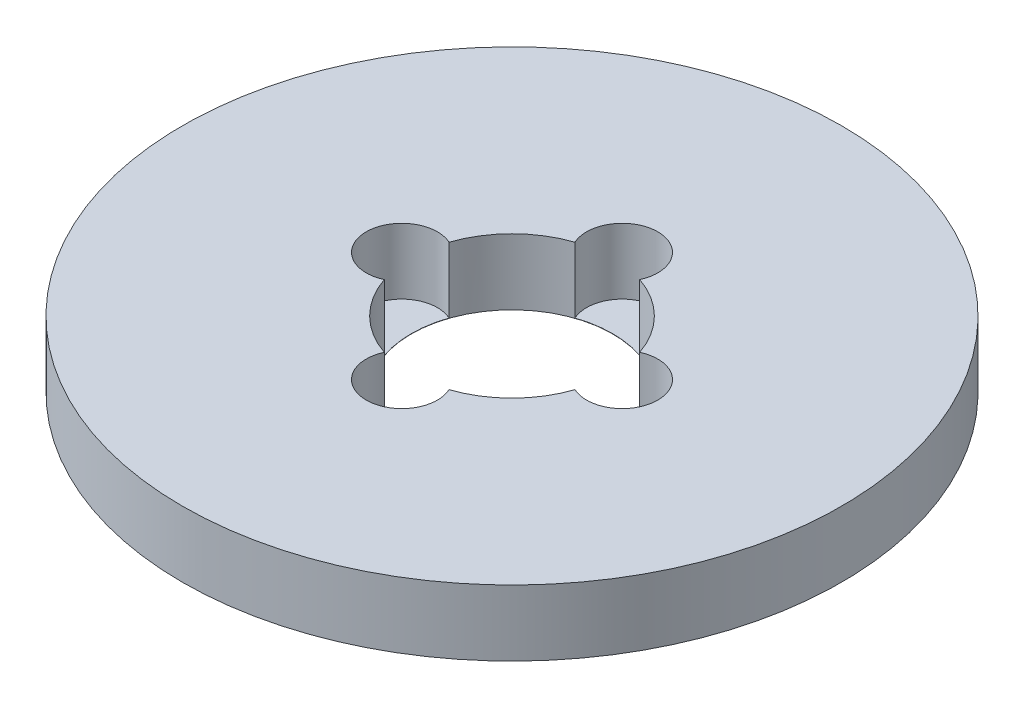
ISO-10303-21;
HEADER;
FILE_DESCRIPTION(('STEP AP214'),'2;1');
FILE_NAME('part.step','',(''),(''),'','','');
FILE_SCHEMA(('AUTOMOTIVE_DESIGN { 1 0 10303 214 1 1 1 1 }'));
ENDSEC;
DATA;
#1=APPLICATION_CONTEXT('core data for automotive mechanical design processes');
#2=APPLICATION_PROTOCOL_DEFINITION('international standard','automotive_design',2000,#1);
#3=PRODUCT_CONTEXT('',#1,'mechanical');
#4=PRODUCT('Part','Part','',(#3));
#5=PRODUCT_RELATED_PRODUCT_CATEGORY('part','',(#4));
#6=PRODUCT_DEFINITION_FORMATION('','',#4);
#7=PRODUCT_DEFINITION_CONTEXT('part definition',#1,'design');
#8=PRODUCT_DEFINITION('design','',#6,#7);
#9=PRODUCT_DEFINITION_SHAPE('','',#8);
#10=(LENGTH_UNIT() NAMED_UNIT(*) SI_UNIT(.MILLI.,.METRE.));
#11=(NAMED_UNIT(*) PLANE_ANGLE_UNIT() SI_UNIT($,.RADIAN.));
#12=(NAMED_UNIT(*) SI_UNIT($,.STERADIAN.) SOLID_ANGLE_UNIT());
#13=UNCERTAINTY_MEASURE_WITH_UNIT(LENGTH_MEASURE(1.E-05),#10,'distance_accuracy_value','');
#14=(GEOMETRIC_REPRESENTATION_CONTEXT(3) GLOBAL_UNCERTAINTY_ASSIGNED_CONTEXT((#13)) GLOBAL_UNIT_ASSIGNED_CONTEXT((#10,
#11,#12)) REPRESENTATION_CONTEXT('',''));
#15=CARTESIAN_POINT('',(0.,0.,0.));
#16=DIRECTION('',(0.,0.,1.));
#17=DIRECTION('',(1.,0.,0.));
#18=AXIS2_PLACEMENT_3D('',#15,#16,#17);
#19=CARTESIAN_POINT('',(0.,18.,0.));
#20=DIRECTION('',(0.,-1.,0.));
#21=DIRECTION('',(0.,0.,-1.));
#22=AXIS2_PLACEMENT_3D('',#19,#20,#21);
#23=CYLINDRICAL_SURFACE('',#22,90.);
#24=CARTESIAN_POINT('',(0.,18.,0.));
#25=DIRECTION('',(0.,1.,0.));
#26=DIRECTION('',(0.,0.,1.));
#27=AXIS2_PLACEMENT_3D('',#24,#25,#26);
#28=CIRCLE('',#27,90.);
#29=CARTESIAN_POINT('',(0.,18.,90.));
#30=VERTEX_POINT('',#29);
#31=EDGE_CURVE('E145',#30,#30,#28,.T.);
#32=ORIENTED_EDGE('',*,*,#31,.F.);
#33=EDGE_LOOP('',(#32));
#34=FACE_BOUND('',#33,.T.);
#35=CARTESIAN_POINT('',(0.,0.,0.));
#36=DIRECTION('',(0.,1.,0.));
#37=DIRECTION('',(0.,0.,1.));
#38=AXIS2_PLACEMENT_3D('',#35,#36,#37);
#39=CIRCLE('',#38,90.);
#40=CARTESIAN_POINT('',(0.,0.,90.));
#41=VERTEX_POINT('',#40);
#42=EDGE_CURVE('E143',#41,#41,#39,.T.);
#43=ORIENTED_EDGE('',*,*,#42,.T.);
#44=EDGE_LOOP('',(#43));
#45=FACE_BOUND('',#44,.T.);
#46=ADVANCED_FACE('F39',(#34,#45),#23,.T.);
#47=CARTESIAN_POINT('',(0.,18.,0.));
#48=DIRECTION('',(0.,1.,0.));
#49=DIRECTION('',(0.,0.,1.));
#50=AXIS2_PLACEMENT_3D('',#47,#48,#49);
#51=PLANE('',#50);
#52=CARTESIAN_POINT('',(1.05056466496162E-13,18.,30.0893678930479));
#53=DIRECTION('',(0.,1.,0.));
#54=DIRECTION('',(1.,0.,0.));
#55=AXIS2_PLACEMENT_3D('',#52,#53,#54);
#56=CIRCLE('',#55,9.72604863078452);
#57=CARTESIAN_POINT('',(-8.84276944870106,18.,26.03949746975));
#58=VERTEX_POINT('',#57);
#59=CARTESIAN_POINT('',(8.84276944870125,18.,26.03949746975));
#60=VERTEX_POINT('',#59);
#61=EDGE_CURVE('E152',#58,#60,#56,.T.);
#62=ORIENTED_EDGE('',*,*,#61,.F.);
#63=CARTESIAN_POINT('',(0.,18.,0.));
#64=DIRECTION('',(0.,1.,0.));
#65=DIRECTION('',(0.,0.,1.));
#66=AXIS2_PLACEMENT_3D('',#63,#64,#65);
#67=CIRCLE('',#66,27.5);
#68=CARTESIAN_POINT('',(-26.03949746975,18.,8.84276944870115));
#69=VERTEX_POINT('',#68);
#70=EDGE_CURVE('E133',#69,#58,#67,.T.);
#71=ORIENTED_EDGE('',*,*,#70,.F.);
#72=CARTESIAN_POINT('',(-30.0893678930479,18.,0.));
#73=DIRECTION('',(0.,1.,0.));
#74=DIRECTION('',(0.,0.,1.));
#75=AXIS2_PLACEMENT_3D('',#72,#73,#74);
#76=CIRCLE('',#75,9.72604863078452);
#77=CARTESIAN_POINT('',(-26.03949746975,18.,-8.84276944870115));
#78=VERTEX_POINT('',#77);
#79=EDGE_CURVE('E128',#78,#69,#76,.T.);
#80=ORIENTED_EDGE('',*,*,#79,.F.);
#81=CARTESIAN_POINT('',(-8.84276944870143,18.,-26.0394974697499));
#82=VERTEX_POINT('',#81);
#83=EDGE_CURVE('E121',#82,#78,#67,.T.);
#84=ORIENTED_EDGE('',*,*,#83,.F.);
#85=CARTESIAN_POINT('',(-3.15169399488487E-13,18.,-30.0893678930479));
#86=DIRECTION('',(0.,1.,0.));
#87=DIRECTION('',(-1.,0.,0.));
#88=AXIS2_PLACEMENT_3D('',#85,#86,#87);
#89=CIRCLE('',#88,9.72604863078452);
#90=CARTESIAN_POINT('',(8.84276944870088,18.,-26.0394974697501));
#91=VERTEX_POINT('',#90);
#92=EDGE_CURVE('E105',#91,#82,#89,.T.);
#93=ORIENTED_EDGE('',*,*,#92,.F.);
#94=CARTESIAN_POINT('',(26.03949746975,18.,-8.84276944870115));
#95=VERTEX_POINT('',#94);
#96=EDGE_CURVE('E131',#95,#91,#67,.T.);
#97=ORIENTED_EDGE('',*,*,#96,.F.);
#98=CARTESIAN_POINT('',(30.0893678930479,18.,0.));
#99=DIRECTION('',(0.,1.,0.));
#100=DIRECTION('',(0.,0.,-1.));
#101=AXIS2_PLACEMENT_3D('',#98,#99,#100);
#102=CIRCLE('',#101,9.72604863078452);
#103=CARTESIAN_POINT('',(26.03949746975,18.,8.84276944870115));
#104=VERTEX_POINT('',#103);
#105=EDGE_CURVE('E154',#104,#95,#102,.T.);
#106=ORIENTED_EDGE('',*,*,#105,.F.);
#107=EDGE_CURVE('E134',#60,#104,#67,.T.);
#108=ORIENTED_EDGE('',*,*,#107,.F.);
#109=EDGE_LOOP('',(#62,#71,#80,#84,#93,#97,#106,#108));
#110=FACE_BOUND('',#109,.T.);
#111=ORIENTED_EDGE('',*,*,#31,.T.);
#112=EDGE_LOOP('',(#111));
#113=FACE_BOUND('',#112,.T.);
#114=ADVANCED_FACE('F130',(#110,#113),#51,.T.);
#115=CARTESIAN_POINT('',(0.,0.,0.));
#116=DIRECTION('',(0.,1.,0.));
#117=DIRECTION('',(0.,0.,1.));
#118=AXIS2_PLACEMENT_3D('',#115,#116,#117);
#119=PLANE('',#118);
#120=CARTESIAN_POINT('',(0.,0.,0.));
#121=DIRECTION('',(0.,1.,0.));
#122=DIRECTION('',(0.,0.,1.));
#123=AXIS2_PLACEMENT_3D('',#120,#121,#122);
#124=CIRCLE('',#123,27.5);
#125=CARTESIAN_POINT('',(0.,0.,27.5));
#126=VERTEX_POINT('',#125);
#127=EDGE_CURVE('E135',#126,#126,#124,.T.);
#128=ORIENTED_EDGE('',*,*,#127,.T.);
#129=EDGE_LOOP('',(#128));
#130=FACE_BOUND('',#129,.T.);
#131=ORIENTED_EDGE('',*,*,#42,.F.);
#132=EDGE_LOOP('',(#131));
#133=FACE_BOUND('',#132,.T.);
#134=ADVANCED_FACE('F195',(#130,#133),#119,.F.);
#135=CARTESIAN_POINT('',(0.,18.,0.));
#136=DIRECTION('',(0.,-1.,0.));
#137=DIRECTION('',(0.,0.,-1.));
#138=AXIS2_PLACEMENT_3D('',#135,#136,#137);
#139=CYLINDRICAL_SURFACE('',#138,27.5);
#140=DIRECTION('',(0.,1.,0.));
#141=VECTOR('',#140,1.);
#142=CARTESIAN_POINT('',(-8.84276944870106,9.03302219480292,26.0394974697501));
#143=LINE('',#142,#141);
#144=CARTESIAN_POINT('',(-8.84276944870106,0.0660443896058419,26.03949746975));
#145=VERTEX_POINT('',#144);
#146=EDGE_CURVE('E11',#145,#58,#143,.T.);
#147=ORIENTED_EDGE('',*,*,#146,.F.);
#148=CARTESIAN_POINT('',(0.,0.0660443896058419,0.));
#149=DIRECTION('',(0.,1.,0.));
#150=DIRECTION('',(0.,0.,1.));
#151=AXIS2_PLACEMENT_3D('',#148,#149,#150);
#152=CIRCLE('',#151,27.5);
#153=CARTESIAN_POINT('',(8.84276944870125,0.0660443896058419,26.03949746975));
#154=VERTEX_POINT('',#153);
#155=EDGE_CURVE('E169',#145,#154,#152,.T.);
#156=ORIENTED_EDGE('',*,*,#155,.T.);
#157=DIRECTION('',(0.,1.,0.));
#158=VECTOR('',#157,1.);
#159=CARTESIAN_POINT('',(8.84276944870125,9.03302219480292,26.03949746975));
#160=LINE('',#159,#158);
#161=EDGE_CURVE('E46',#60,#154,#160,.F.);
#162=ORIENTED_EDGE('',*,*,#161,.F.);
#163=ORIENTED_EDGE('',*,*,#107,.T.);
#164=DIRECTION('',(0.,1.,0.));
#165=VECTOR('',#164,1.);
#166=CARTESIAN_POINT('',(26.03949746975,9.03302219480292,8.84276944870115));
#167=LINE('',#166,#165);
#168=CARTESIAN_POINT('',(26.03949746975,0.0660443896058419,8.84276944870115));
#169=VERTEX_POINT('',#168);
#170=EDGE_CURVE('E151',#169,#104,#167,.T.);
#171=ORIENTED_EDGE('',*,*,#170,.F.);
#172=CARTESIAN_POINT('',(0.,0.0660443896058419,0.));
#173=DIRECTION('',(0.,1.,0.));
#174=DIRECTION('',(0.,0.,1.));
#175=AXIS2_PLACEMENT_3D('',#172,#173,#174);
#176=CIRCLE('',#175,27.5);
#177=CARTESIAN_POINT('',(26.03949746975,0.0660443896058419,-8.84276944870115));
#178=VERTEX_POINT('',#177);
#179=EDGE_CURVE('E173',#169,#178,#176,.T.);
#180=ORIENTED_EDGE('',*,*,#179,.T.);
#181=DIRECTION('',(0.,1.,0.));
#182=VECTOR('',#181,1.);
#183=CARTESIAN_POINT('',(26.03949746975,9.03302219480292,-8.84276944870115));
#184=LINE('',#183,#182);
#185=EDGE_CURVE('E168',#95,#178,#184,.F.);
#186=ORIENTED_EDGE('',*,*,#185,.F.);
#187=ORIENTED_EDGE('',*,*,#96,.T.);
#188=DIRECTION('',(0.,1.,0.));
#189=VECTOR('',#188,1.);
#190=CARTESIAN_POINT('',(8.84276944870088,9.03302219480292,-26.0394974697501));
#191=LINE('',#190,#189);
#192=CARTESIAN_POINT('',(8.84276944870088,0.0660443896058419,-26.0394974697501));
#193=VERTEX_POINT('',#192);
#194=EDGE_CURVE('E108',#193,#91,#191,.T.);
#195=ORIENTED_EDGE('',*,*,#194,.F.);
#196=CARTESIAN_POINT('',(0.,0.0660443896058419,0.));
#197=DIRECTION('',(0.,1.,0.));
#198=DIRECTION('',(0.,0.,1.));
#199=AXIS2_PLACEMENT_3D('',#196,#197,#198);
#200=CIRCLE('',#199,27.5);
#201=CARTESIAN_POINT('',(-8.84276944870143,0.0660443896058419,-26.0394974697499));
#202=VERTEX_POINT('',#201);
#203=EDGE_CURVE('E122',#193,#202,#200,.T.);
#204=ORIENTED_EDGE('',*,*,#203,.T.);
#205=DIRECTION('',(0.,1.,0.));
#206=VECTOR('',#205,1.);
#207=CARTESIAN_POINT('',(-8.84276944870143,9.03302219480292,-26.0394974697499));
#208=LINE('',#207,#206);
#209=EDGE_CURVE('E106',#82,#202,#208,.F.);
#210=ORIENTED_EDGE('',*,*,#209,.F.);
#211=ORIENTED_EDGE('',*,*,#83,.T.);
#212=DIRECTION('',(0.,1.,0.));
#213=VECTOR('',#212,1.);
#214=CARTESIAN_POINT('',(-26.03949746975,9.03302219480292,-8.84276944870115));
#215=LINE('',#214,#213);
#216=CARTESIAN_POINT('',(-26.03949746975,0.0660443896058419,-8.84276944870115));
#217=VERTEX_POINT('',#216);
#218=EDGE_CURVE('E177',#217,#78,#215,.T.);
#219=ORIENTED_EDGE('',*,*,#218,.F.);
#220=CARTESIAN_POINT('',(0.,0.0660443896058419,0.));
#221=DIRECTION('',(0.,1.,0.));
#222=DIRECTION('',(0.,0.,1.));
#223=AXIS2_PLACEMENT_3D('',#220,#221,#222);
#224=CIRCLE('',#223,27.5);
#225=CARTESIAN_POINT('',(-26.03949746975,0.0660443896058419,8.84276944870115));
#226=VERTEX_POINT('',#225);
#227=EDGE_CURVE('E185',#217,#226,#224,.T.);
#228=ORIENTED_EDGE('',*,*,#227,.T.);
#229=DIRECTION('',(0.,1.,0.));
#230=VECTOR('',#229,1.);
#231=CARTESIAN_POINT('',(-26.03949746975,9.03302219480292,8.84276944870115));
#232=LINE('',#231,#230);
#233=EDGE_CURVE('E179',#69,#226,#232,.F.);
#234=ORIENTED_EDGE('',*,*,#233,.F.);
#235=ORIENTED_EDGE('',*,*,#70,.T.);
#236=EDGE_LOOP('',(#147,#156,#162,#163,#171,#180,#186,#187,#195,#204,#210,#211,#219,#228,#234,#235));
#237=FACE_BOUND('',#236,.T.);
#238=ORIENTED_EDGE('',*,*,#127,.F.);
#239=EDGE_LOOP('',(#238));
#240=FACE_BOUND('',#239,.T.);
#241=ADVANCED_FACE('F117',(#237,#240),#139,.F.);
#242=CARTESIAN_POINT('',(-30.0893678930479,0.0660443896058419,0.));
#243=DIRECTION('',(0.,1.,0.));
#244=DIRECTION('',(0.,0.,1.));
#245=AXIS2_PLACEMENT_3D('',#242,#243,#244);
#246=CYLINDRICAL_SURFACE('',#245,9.72604863078452);
#247=ORIENTED_EDGE('',*,*,#218,.T.);
#248=ORIENTED_EDGE('',*,*,#79,.T.);
#249=ORIENTED_EDGE('',*,*,#233,.T.);
#250=CARTESIAN_POINT('',(-30.0893678930479,0.0660443896058419,0.));
#251=DIRECTION('',(0.,1.,0.));
#252=DIRECTION('',(0.,0.,1.));
#253=AXIS2_PLACEMENT_3D('',#250,#251,#252);
#254=CIRCLE('',#253,9.72604863078452);
#255=EDGE_CURVE('E140',#217,#226,#254,.T.);
#256=ORIENTED_EDGE('',*,*,#255,.F.);
#257=EDGE_LOOP('',(#247,#248,#249,#256));
#258=FACE_BOUND('',#257,.T.);
#259=ADVANCED_FACE('F200',(#258),#246,.F.);
#260=CARTESIAN_POINT('',(-30.0893678930479,0.0660443896058419,0.));
#261=DIRECTION('',(0.,1.,0.));
#262=DIRECTION('',(0.,0.,1.));
#263=AXIS2_PLACEMENT_3D('',#260,#261,#262);
#264=PLANE('',#263);
#265=ORIENTED_EDGE('',*,*,#255,.T.);
#266=ORIENTED_EDGE('',*,*,#227,.F.);
#267=EDGE_LOOP('',(#265,#266));
#268=FACE_BOUND('',#267,.T.);
#269=ADVANCED_FACE('F202',(#268),#264,.T.);
#270=CARTESIAN_POINT('',(-3.15169399488487E-13,0.0660443896058419,-30.0893678930479));
#271=DIRECTION('',(0.,1.,0.));
#272=DIRECTION('',(0.,0.,1.));
#273=AXIS2_PLACEMENT_3D('',#270,#271,#272);
#274=CYLINDRICAL_SURFACE('',#273,9.72604863078452);
#275=ORIENTED_EDGE('',*,*,#194,.T.);
#276=ORIENTED_EDGE('',*,*,#92,.T.);
#277=ORIENTED_EDGE('',*,*,#209,.T.);
#278=CARTESIAN_POINT('',(-3.15169399488487E-13,0.0660443896058419,-30.0893678930479));
#279=DIRECTION('',(0.,1.,0.));
#280=DIRECTION('',(-1.,0.,0.));
#281=AXIS2_PLACEMENT_3D('',#278,#279,#280);
#282=CIRCLE('',#281,9.72604863078452);
#283=EDGE_CURVE('E111',#193,#202,#282,.T.);
#284=ORIENTED_EDGE('',*,*,#283,.F.);
#285=EDGE_LOOP('',(#275,#276,#277,#284));
#286=FACE_BOUND('',#285,.T.);
#287=ADVANCED_FACE('F102',(#286),#274,.F.);
#288=CARTESIAN_POINT('',(-3.15169399488487E-13,0.0660443896058419,-30.0893678930479));
#289=DIRECTION('',(0.,1.,0.));
#290=DIRECTION('',(-1.,0.,0.));
#291=AXIS2_PLACEMENT_3D('',#288,#289,#290);
#292=PLANE('',#291);
#293=ORIENTED_EDGE('',*,*,#283,.T.);
#294=ORIENTED_EDGE('',*,*,#203,.F.);
#295=EDGE_LOOP('',(#293,#294));
#296=FACE_BOUND('',#295,.T.);
#297=ADVANCED_FACE('F211',(#296),#292,.T.);
#298=CARTESIAN_POINT('',(30.0893678930479,0.0660443896058419,0.));
#299=DIRECTION('',(0.,1.,0.));
#300=DIRECTION('',(0.,0.,1.));
#301=AXIS2_PLACEMENT_3D('',#298,#299,#300);
#302=CYLINDRICAL_SURFACE('',#301,9.72604863078452);
#303=ORIENTED_EDGE('',*,*,#170,.T.);
#304=ORIENTED_EDGE('',*,*,#105,.T.);
#305=ORIENTED_EDGE('',*,*,#185,.T.);
#306=CARTESIAN_POINT('',(30.0893678930479,0.0660443896058419,0.));
#307=DIRECTION('',(0.,1.,0.));
#308=DIRECTION('',(0.,0.,-1.));
#309=AXIS2_PLACEMENT_3D('',#306,#307,#308);
#310=CIRCLE('',#309,9.72604863078452);
#311=EDGE_CURVE('E56',#169,#178,#310,.T.);
#312=ORIENTED_EDGE('',*,*,#311,.F.);
#313=EDGE_LOOP('',(#303,#304,#305,#312));
#314=FACE_BOUND('',#313,.T.);
#315=ADVANCED_FACE('F212',(#314),#302,.F.);
#316=CARTESIAN_POINT('',(30.0893678930479,0.0660443896058419,0.));
#317=DIRECTION('',(0.,1.,0.));
#318=DIRECTION('',(0.,0.,-1.));
#319=AXIS2_PLACEMENT_3D('',#316,#317,#318);
#320=PLANE('',#319);
#321=ORIENTED_EDGE('',*,*,#311,.T.);
#322=ORIENTED_EDGE('',*,*,#179,.F.);
#323=EDGE_LOOP('',(#321,#322));
#324=FACE_BOUND('',#323,.T.);
#325=ADVANCED_FACE('F217',(#324),#320,.T.);
#326=CARTESIAN_POINT('',(1.05056466496162E-13,0.0660443896058419,30.0893678930479));
#327=DIRECTION('',(0.,1.,0.));
#328=DIRECTION('',(0.,0.,1.));
#329=AXIS2_PLACEMENT_3D('',#326,#327,#328);
#330=CYLINDRICAL_SURFACE('',#329,9.72604863078452);
#331=ORIENTED_EDGE('',*,*,#146,.T.);
#332=ORIENTED_EDGE('',*,*,#61,.T.);
#333=ORIENTED_EDGE('',*,*,#161,.T.);
#334=CARTESIAN_POINT('',(1.05056466496162E-13,0.0660443896058419,30.0893678930479));
#335=DIRECTION('',(0.,1.,0.));
#336=DIRECTION('',(1.,0.,0.));
#337=AXIS2_PLACEMENT_3D('',#334,#335,#336);
#338=CIRCLE('',#337,9.72604863078452);
#339=EDGE_CURVE('E55',#145,#154,#338,.T.);
#340=ORIENTED_EDGE('',*,*,#339,.F.);
#341=EDGE_LOOP('',(#331,#332,#333,#340));
#342=FACE_BOUND('',#341,.T.);
#343=ADVANCED_FACE('F170',(#342),#330,.F.);
#344=CARTESIAN_POINT('',(1.05056466496162E-13,0.0660443896058419,30.0893678930479));
#345=DIRECTION('',(0.,1.,0.));
#346=DIRECTION('',(1.,0.,0.));
#347=AXIS2_PLACEMENT_3D('',#344,#345,#346);
#348=PLANE('',#347);
#349=ORIENTED_EDGE('',*,*,#339,.T.);
#350=ORIENTED_EDGE('',*,*,#155,.F.);
#351=EDGE_LOOP('',(#349,#350));
#352=FACE_BOUND('',#351,.T.);
#353=ADVANCED_FACE('F224',(#352),#348,.T.);
#354=CLOSED_SHELL('',(#46,#114,#134,#241,#259,#269,#287,#297,#315,#325,#343,#353));
#355=MANIFOLD_SOLID_BREP('B2',#354);
#356=ADVANCED_BREP_SHAPE_REPRESENTATION('',(#18,#355),#14);
#357=SHAPE_DEFINITION_REPRESENTATION(#9,#356);
ENDSEC;
END-ISO-10303-21;
